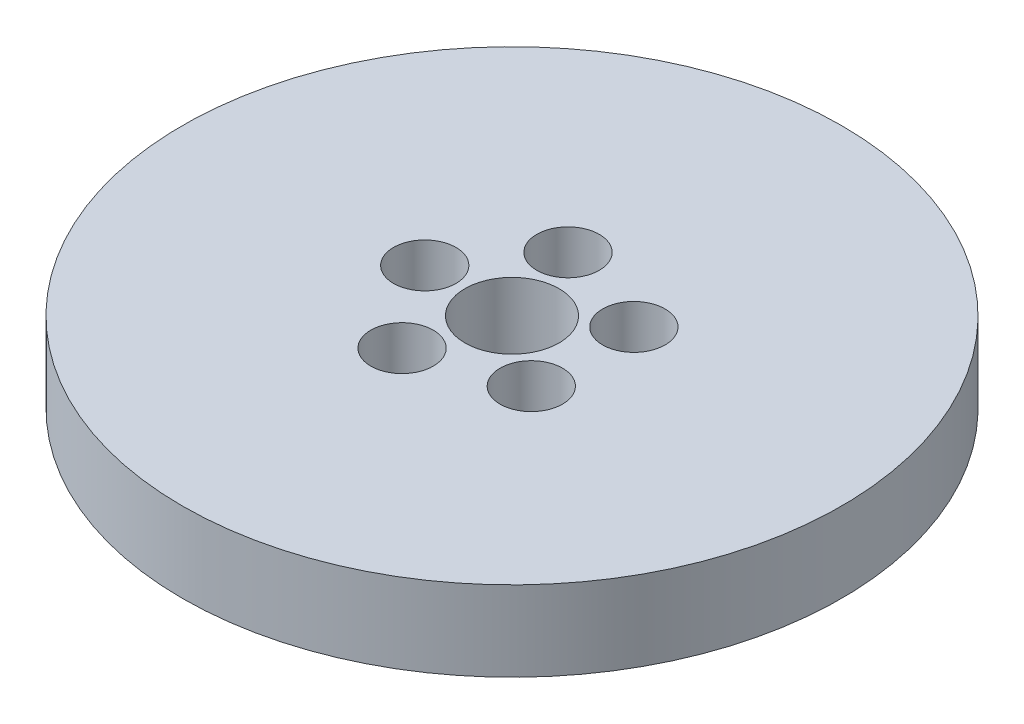
ISO-10303-21;
HEADER;
FILE_DESCRIPTION(('STEP AP214'),'2;1');
FILE_NAME('part.step','',(''),(''),'','','');
FILE_SCHEMA(('AUTOMOTIVE_DESIGN { 1 0 10303 214 1 1 1 1 }'));
ENDSEC;
DATA;
#1=APPLICATION_CONTEXT('core data for automotive mechanical design processes');
#2=APPLICATION_PROTOCOL_DEFINITION('international standard','automotive_design',2000,#1);
#3=PRODUCT_CONTEXT('',#1,'mechanical');
#4=PRODUCT('Part','Part','',(#3));
#5=PRODUCT_RELATED_PRODUCT_CATEGORY('part','',(#4));
#6=PRODUCT_DEFINITION_FORMATION('','',#4);
#7=PRODUCT_DEFINITION_CONTEXT('part definition',#1,'design');
#8=PRODUCT_DEFINITION('design','',#6,#7);
#9=PRODUCT_DEFINITION_SHAPE('','',#8);
#10=(LENGTH_UNIT() NAMED_UNIT(*) SI_UNIT(.MILLI.,.METRE.));
#11=(NAMED_UNIT(*) PLANE_ANGLE_UNIT() SI_UNIT($,.RADIAN.));
#12=(NAMED_UNIT(*) SI_UNIT($,.STERADIAN.) SOLID_ANGLE_UNIT());
#13=UNCERTAINTY_MEASURE_WITH_UNIT(LENGTH_MEASURE(1.E-05),#10,'distance_accuracy_value','');
#14=(GEOMETRIC_REPRESENTATION_CONTEXT(3) GLOBAL_UNCERTAINTY_ASSIGNED_CONTEXT((#13)) GLOBAL_UNIT_ASSIGNED_CONTEXT((#10,
#11,#12)) REPRESENTATION_CONTEXT('',''));
#15=CARTESIAN_POINT('',(0.,0.,0.));
#16=DIRECTION('',(0.,0.,1.));
#17=DIRECTION('',(1.,0.,0.));
#18=AXIS2_PLACEMENT_3D('',#15,#16,#17);
#19=CARTESIAN_POINT('',(0.,17.,0.));
#20=DIRECTION('',(0.,-1.,0.));
#21=DIRECTION('',(0.,0.,-1.));
#22=AXIS2_PLACEMENT_3D('',#19,#20,#21);
#23=CYLINDRICAL_SURFACE('',#22,70.);
#24=CARTESIAN_POINT('',(0.,17.,0.));
#25=DIRECTION('',(0.,1.,0.));
#26=DIRECTION('',(0.,0.,1.));
#27=AXIS2_PLACEMENT_3D('',#24,#25,#26);
#28=CIRCLE('',#27,70.);
#29=CARTESIAN_POINT('',(0.,17.,70.));
#30=VERTEX_POINT('',#29);
#31=EDGE_CURVE('E10',#30,#30,#28,.T.);
#32=ORIENTED_EDGE('',*,*,#31,.F.);
#33=EDGE_LOOP('',(#32));
#34=FACE_BOUND('',#33,.T.);
#35=CARTESIAN_POINT('',(0.,0.,0.));
#36=DIRECTION('',(0.,1.,0.));
#37=DIRECTION('',(0.,0.,1.));
#38=AXIS2_PLACEMENT_3D('',#35,#36,#37);
#39=CIRCLE('',#38,70.);
#40=CARTESIAN_POINT('',(0.,0.,70.));
#41=VERTEX_POINT('',#40);
#42=EDGE_CURVE('E37',#41,#41,#39,.T.);
#43=ORIENTED_EDGE('',*,*,#42,.T.);
#44=EDGE_LOOP('',(#43));
#45=FACE_BOUND('',#44,.T.);
#46=ADVANCED_FACE('F40',(#34,#45),#23,.T.);
#47=CARTESIAN_POINT('',(0.,17.,0.));
#48=DIRECTION('',(0.,1.,0.));
#49=DIRECTION('',(0.,0.,1.));
#50=AXIS2_PLACEMENT_3D('',#47,#48,#49);
#51=PLANE('',#50);
#52=CARTESIAN_POINT('',(-5.72647778566137,17.,-17.6242864069291));
#53=DIRECTION('',(0.,1.,0.));
#54=DIRECTION('',(-0.95105651629515,0.,0.309016994374958));
#55=AXIS2_PLACEMENT_3D('',#52,#53,#54);
#56=CIRCLE('',#55,6.6329048274765);
#57=CARTESIAN_POINT('',(-5.72647778566137,17.,-10.9913815794526));
#58=VERTEX_POINT('',#57);
#59=EDGE_CURVE('E70',#58,#58,#56,.T.);
#60=ORIENTED_EDGE('',*,*,#59,.F.);
#61=EDGE_LOOP('',(#60));
#62=FACE_BOUND('',#61,.T.);
#63=CARTESIAN_POINT('',(14.9921134786821,17.,-10.8924080269451));
#64=DIRECTION('',(0.,1.,0.));
#65=DIRECTION('',(-0.58778525229248,0.,-0.809016994374942));
#66=AXIS2_PLACEMENT_3D('',#63,#64,#65);
#67=CIRCLE('',#66,6.6329048274765);
#68=CARTESIAN_POINT('',(14.9921134786821,17.,-4.25950319946863));
#69=VERTEX_POINT('',#68);
#70=EDGE_CURVE('E71',#69,#69,#67,.T.);
#71=ORIENTED_EDGE('',*,*,#70,.F.);
#72=EDGE_LOOP('',(#71));
#73=FACE_BOUND('',#72,.T.);
#74=CARTESIAN_POINT('',(14.9921134786822,17.,10.8924080269449));
#75=DIRECTION('',(0.,1.,0.));
#76=DIRECTION('',(0.587785252292469,0.,-0.809016994374951));
#77=AXIS2_PLACEMENT_3D('',#74,#75,#76);
#78=CIRCLE('',#77,6.6329048274765);
#79=CARTESIAN_POINT('',(14.9921134786822,17.,17.5253128544214));
#80=VERTEX_POINT('',#79);
#81=EDGE_CURVE('E78',#80,#80,#78,.T.);
#82=ORIENTED_EDGE('',*,*,#81,.F.);
#83=EDGE_LOOP('',(#82));
#84=FACE_BOUND('',#83,.T.);
#85=CARTESIAN_POINT('',(-5.72647778566112,17.,17.6242864069292));
#86=DIRECTION('',(0.,1.,0.));
#87=DIRECTION('',(0.951056516295155,0.,0.309016994374945));
#88=AXIS2_PLACEMENT_3D('',#85,#86,#87);
#89=CIRCLE('',#88,6.6329048274765);
#90=CARTESIAN_POINT('',(-5.72647778566112,17.,24.2571912344057));
#91=VERTEX_POINT('',#90);
#92=EDGE_CURVE('E61',#91,#91,#89,.T.);
#93=ORIENTED_EDGE('',*,*,#92,.F.);
#94=EDGE_LOOP('',(#93));
#95=FACE_BOUND('',#94,.T.);
#96=CARTESIAN_POINT('',(-18.531271386042,17.,0.));
#97=DIRECTION('',(0.,1.,0.));
#98=DIRECTION('',(0.,0.,1.));
#99=AXIS2_PLACEMENT_3D('',#96,#97,#98);
#100=CIRCLE('',#99,6.6329048274765);
#101=CARTESIAN_POINT('',(-18.531271386042,17.,6.6329048274765));
#102=VERTEX_POINT('',#101);
#103=EDGE_CURVE('E54',#102,#102,#100,.T.);
#104=ORIENTED_EDGE('',*,*,#103,.F.);
#105=EDGE_LOOP('',(#104));
#106=FACE_BOUND('',#105,.T.);
#107=CARTESIAN_POINT('',(0.,17.,0.));
#108=DIRECTION('',(0.,1.,0.));
#109=DIRECTION('',(0.,0.,1.));
#110=AXIS2_PLACEMENT_3D('',#107,#108,#109);
#111=CIRCLE('',#110,10.);
#112=CARTESIAN_POINT('',(0.,17.,10.));
#113=VERTEX_POINT('',#112);
#114=EDGE_CURVE('E50',#113,#113,#111,.T.);
#115=ORIENTED_EDGE('',*,*,#114,.F.);
#116=EDGE_LOOP('',(#115));
#117=FACE_BOUND('',#116,.T.);
#118=ORIENTED_EDGE('',*,*,#31,.T.);
#119=EDGE_LOOP('',(#118));
#120=FACE_BOUND('',#119,.T.);
#121=ADVANCED_FACE('F94',(#62,#73,#84,#95,#106,#117,#120),#51,.T.);
#122=CARTESIAN_POINT('',(0.,0.,0.));
#123=DIRECTION('',(0.,1.,0.));
#124=DIRECTION('',(0.,0.,1.));
#125=AXIS2_PLACEMENT_3D('',#122,#123,#124);
#126=PLANE('',#125);
#127=CARTESIAN_POINT('',(0.,0.,0.));
#128=DIRECTION('',(0.,1.,0.));
#129=DIRECTION('',(0.,0.,1.));
#130=AXIS2_PLACEMENT_3D('',#127,#128,#129);
#131=CIRCLE('',#130,10.);
#132=CARTESIAN_POINT('',(0.,0.,10.));
#133=VERTEX_POINT('',#132);
#134=EDGE_CURVE('E47',#133,#133,#131,.T.);
#135=ORIENTED_EDGE('',*,*,#134,.T.);
#136=EDGE_LOOP('',(#135));
#137=FACE_BOUND('',#136,.T.);
#138=ORIENTED_EDGE('',*,*,#42,.F.);
#139=EDGE_LOOP('',(#138));
#140=FACE_BOUND('',#139,.T.);
#141=ADVANCED_FACE('F100',(#137,#140),#126,.F.);
#142=CARTESIAN_POINT('',(0.,17.,0.));
#143=DIRECTION('',(0.,-1.,0.));
#144=DIRECTION('',(0.,0.,-1.));
#145=AXIS2_PLACEMENT_3D('',#142,#143,#144);
#146=CYLINDRICAL_SURFACE('',#145,10.);
#147=ORIENTED_EDGE('',*,*,#114,.T.);
#148=EDGE_LOOP('',(#147));
#149=FACE_BOUND('',#148,.T.);
#150=ORIENTED_EDGE('',*,*,#134,.F.);
#151=EDGE_LOOP('',(#150));
#152=FACE_BOUND('',#151,.T.);
#153=ADVANCED_FACE('F106',(#149,#152),#146,.F.);
#154=CARTESIAN_POINT('',(-18.531271386042,2.63415524458478,0.));
#155=DIRECTION('',(0.,1.,0.));
#156=DIRECTION('',(0.,0.,1.));
#157=AXIS2_PLACEMENT_3D('',#154,#155,#156);
#158=CYLINDRICAL_SURFACE('',#157,6.6329048274765);
#159=CARTESIAN_POINT('',(-18.531271386042,2.63415524458478,0.));
#160=DIRECTION('',(0.,1.,0.));
#161=DIRECTION('',(0.,0.,1.));
#162=AXIS2_PLACEMENT_3D('',#159,#160,#161);
#163=CIRCLE('',#162,6.6329048274765);
#164=CARTESIAN_POINT('',(-18.531271386042,2.63415524458478,6.6329048274765));
#165=VERTEX_POINT('',#164);
#166=EDGE_CURVE('E55',#165,#165,#163,.T.);
#167=CARTESIAN_POINT('',(-18.531271386042,2.63415524458478,6.6329048274765));
#168=CARTESIAN_POINT('',(-18.531271386042,2.78379946078702,6.6329048274765));
#169=CARTESIAN_POINT('',(-18.531271386042,2.93344367698927,6.6329048274765));
#170=CARTESIAN_POINT('',(-18.531271386042,3.23273210939375,6.6329048274765));
#171=CARTESIAN_POINT('',(-18.531271386042,3.38237632559599,6.6329048274765));
#172=CARTESIAN_POINT('',(-18.531271386042,3.68166475800047,6.6329048274765));
#173=CARTESIAN_POINT('',(-18.531271386042,3.83130897420272,6.6329048274765));
#174=CARTESIAN_POINT('',(-18.531271386042,4.1305974066072,6.6329048274765));
#175=CARTESIAN_POINT('',(-18.531271386042,4.28024162280944,6.6329048274765));
#176=CARTESIAN_POINT('',(-18.531271386042,4.57953005521393,6.6329048274765));
#177=CARTESIAN_POINT('',(-18.531271386042,4.72917427141617,6.6329048274765));
#178=CARTESIAN_POINT('',(-18.531271386042,5.02846270382065,6.6329048274765));
#179=CARTESIAN_POINT('',(-18.531271386042,5.17810692002289,6.6329048274765));
#180=CARTESIAN_POINT('',(-18.531271386042,5.47739535242738,6.6329048274765));
#181=CARTESIAN_POINT('',(-18.531271386042,5.62703956862962,6.6329048274765));
#182=CARTESIAN_POINT('',(-18.531271386042,5.9263280010341,6.6329048274765));
#183=CARTESIAN_POINT('',(-18.531271386042,6.07597221723634,6.6329048274765));
#184=CARTESIAN_POINT('',(-18.531271386042,6.37526064964083,6.6329048274765));
#185=CARTESIAN_POINT('',(-18.531271386042,6.52490486584307,6.6329048274765));
#186=CARTESIAN_POINT('',(-18.531271386042,6.82419329824755,6.6329048274765));
#187=CARTESIAN_POINT('',(-18.531271386042,6.9738375144498,6.6329048274765));
#188=CARTESIAN_POINT('',(-18.531271386042,7.27312594685428,6.6329048274765));
#189=CARTESIAN_POINT('',(-18.531271386042,7.42277016305652,6.6329048274765));
#190=CARTESIAN_POINT('',(-18.531271386042,7.722058595461,6.6329048274765));
#191=CARTESIAN_POINT('',(-18.531271386042,7.87170281166325,6.6329048274765));
#192=CARTESIAN_POINT('',(-18.531271386042,8.17099124406773,6.6329048274765));
#193=CARTESIAN_POINT('',(-18.531271386042,8.32063546026997,6.6329048274765));
#194=CARTESIAN_POINT('',(-18.531271386042,8.61992389267446,6.6329048274765));
#195=CARTESIAN_POINT('',(-18.531271386042,8.7695681088767,6.6329048274765));
#196=CARTESIAN_POINT('',(-18.531271386042,9.06885654128118,6.6329048274765));
#197=CARTESIAN_POINT('',(-18.531271386042,9.21850075748342,6.6329048274765));
#198=CARTESIAN_POINT('',(-18.531271386042,9.51778918988791,6.6329048274765));
#199=CARTESIAN_POINT('',(-18.531271386042,9.66743340609015,6.6329048274765));
#200=CARTESIAN_POINT('',(-18.531271386042,9.96672183849463,6.6329048274765));
#201=CARTESIAN_POINT('',(-18.531271386042,10.1163660546969,6.6329048274765));
#202=CARTESIAN_POINT('',(-18.531271386042,10.4156544871014,6.6329048274765));
#203=CARTESIAN_POINT('',(-18.531271386042,10.5652987033036,6.6329048274765));
#204=CARTESIAN_POINT('',(-18.531271386042,10.8645871357081,6.6329048274765));
#205=CARTESIAN_POINT('',(-18.531271386042,11.0142313519103,6.6329048274765));
#206=CARTESIAN_POINT('',(-18.531271386042,11.3135197843148,6.6329048274765));
#207=CARTESIAN_POINT('',(-18.531271386042,11.4631640005171,6.6329048274765));
#208=CARTESIAN_POINT('',(-18.531271386042,11.7624524329215,6.6329048274765));
#209=CARTESIAN_POINT('',(-18.531271386042,11.9120966491238,6.6329048274765));
#210=CARTESIAN_POINT('',(-18.531271386042,12.2113850815283,6.6329048274765));
#211=CARTESIAN_POINT('',(-18.531271386042,12.3610292977305,6.6329048274765));
#212=CARTESIAN_POINT('',(-18.531271386042,12.660317730135,6.6329048274765));
#213=CARTESIAN_POINT('',(-18.531271386042,12.8099619463372,6.6329048274765));
#214=CARTESIAN_POINT('',(-18.531271386042,13.1092503787417,6.6329048274765));
#215=CARTESIAN_POINT('',(-18.531271386042,13.258894594944,6.6329048274765));
#216=CARTESIAN_POINT('',(-18.531271386042,13.5581830273484,6.6329048274765));
#217=CARTESIAN_POINT('',(-18.531271386042,13.7078272435507,6.6329048274765));
#218=CARTESIAN_POINT('',(-18.531271386042,14.0071156759552,6.6329048274765));
#219=CARTESIAN_POINT('',(-18.531271386042,14.1567598921574,6.6329048274765));
#220=CARTESIAN_POINT('',(-18.531271386042,14.4560483245619,6.6329048274765));
#221=CARTESIAN_POINT('',(-18.531271386042,14.6056925407641,6.6329048274765));
#222=CARTESIAN_POINT('',(-18.531271386042,14.9049809731686,6.6329048274765));
#223=CARTESIAN_POINT('',(-18.531271386042,15.0546251893709,6.6329048274765));
#224=CARTESIAN_POINT('',(-18.531271386042,15.3539136217753,6.6329048274765));
#225=CARTESIAN_POINT('',(-18.531271386042,15.5035578379776,6.6329048274765));
#226=CARTESIAN_POINT('',(-18.531271386042,15.8028462703821,6.6329048274765));
#227=CARTESIAN_POINT('',(-18.531271386042,15.9524904865843,6.6329048274765));
#228=CARTESIAN_POINT('',(-18.531271386042,16.2517789189888,6.6329048274765));
#229=CARTESIAN_POINT('',(-18.531271386042,16.401423135191,6.6329048274765));
#230=CARTESIAN_POINT('',(-18.531271386042,16.7007115675955,6.6329048274765));
#231=CARTESIAN_POINT('',(-18.531271386042,16.8503557837978,6.6329048274765));
#232=CARTESIAN_POINT('',(-18.531271386042,17.,6.6329048274765));
#233=B_SPLINE_CURVE_WITH_KNOTS('',3,(#167,#168,#169,#170,#171,#172,#173,#174,#175,#176,#177,
#178,#179,#180,#181,#182,#183,#184,#185,#186,#187,#188,#189,#190,#191,#192,#193,#194,#195,#196,
#197,#198,#199,#200,#201,#202,#203,#204,#205,#206,#207,#208,#209,#210,#211,#212,#213,#214,#215,
#216,#217,#218,#219,#220,#221,#222,#223,#224,#225,#226,#227,#228,#229,#230,#231,#232),
.UNSPECIFIED.,.F.,.F.,(4,2,2,2,2,2,2,2,2,2,2,2,2,2,2,2,2,2,2,2,2,2,2,2,2,2,2,2,2,2,2,2,4),(0.,
0.448932648606725,0.897865297213451,1.34679794582018,1.7957305944269,2.24466324303363,
2.69359589164035,3.14252854024708,3.5914611888538,4.04039383746053,4.48932648606726,
4.93825913467398,5.38719178328071,5.83612443188743,6.28505708049416,6.73398972910088,
7.18292237770761,7.63185502631433,8.08078767492106,8.52972032352778,8.97865297213451,
9.42758562074124,9.87651826934796,10.3254509179547,10.7743835665614,11.2233162151681,
11.6722488637749,12.1211815123816,12.5701141609883,13.019046809595,13.4679794582018,
13.9169121068085,14.3658447554152),.UNSPECIFIED.);
#234=EDGE_CURVE('BSEAM108',#165,#102,#233,.T.);
#235=ORIENTED_EDGE('',*,*,#166,.F.);
#236=ORIENTED_EDGE('',*,*,#103,.T.);
#237=ORIENTED_EDGE('',*,*,#234,.T.);
#238=ORIENTED_EDGE('',*,*,#234,.F.);
#239=EDGE_LOOP('',(#235,#237,#236,#238));
#240=FACE_BOUND('',#239,.T.);
#241=ADVANCED_FACE('F108',(#240),#158,.F.);
#242=CARTESIAN_POINT('',(-18.531271386042,2.63415524458478,0.));
#243=DIRECTION('',(0.,1.,0.));
#244=DIRECTION('',(0.,0.,1.));
#245=AXIS2_PLACEMENT_3D('',#242,#243,#244);
#246=PLANE('',#245);
#247=ORIENTED_EDGE('',*,*,#166,.T.);
#248=EDGE_LOOP('',(#247));
#249=FACE_BOUND('',#248,.T.);
#250=ADVANCED_FACE('F138',(#249),#246,.T.);
#251=CARTESIAN_POINT('',(-5.72647778566112,2.63415524458478,17.6242864069292));
#252=DIRECTION('',(0.,1.,0.));
#253=DIRECTION('',(0.,0.,1.));
#254=AXIS2_PLACEMENT_3D('',#251,#252,#253);
#255=CYLINDRICAL_SURFACE('',#254,6.6329048274765);
#256=CARTESIAN_POINT('',(-5.72647778566112,2.63415524458478,17.6242864069292));
#257=DIRECTION('',(0.,1.,0.));
#258=DIRECTION('',(0.951056516295155,0.,0.309016994374945));
#259=AXIS2_PLACEMENT_3D('',#256,#257,#258);
#260=CIRCLE('',#259,6.6329048274765);
#261=CARTESIAN_POINT('',(-5.72647778566112,2.63415524458478,24.2571912344057));
#262=VERTEX_POINT('',#261);
#263=EDGE_CURVE('E59',#262,#262,#260,.T.);
#264=CARTESIAN_POINT('',(-5.72647778566112,2.63415524458478,24.2571912344057));
#265=CARTESIAN_POINT('',(-5.72647778566112,2.78379946078702,24.2571912344057));
#266=CARTESIAN_POINT('',(-5.72647778566112,2.93344367698927,24.2571912344057));
#267=CARTESIAN_POINT('',(-5.72647778566112,3.23273210939375,24.2571912344057));
#268=CARTESIAN_POINT('',(-5.72647778566112,3.38237632559599,24.2571912344057));
#269=CARTESIAN_POINT('',(-5.72647778566112,3.68166475800047,24.2571912344057));
#270=CARTESIAN_POINT('',(-5.72647778566112,3.83130897420272,24.2571912344057));
#271=CARTESIAN_POINT('',(-5.72647778566112,4.1305974066072,24.2571912344057));
#272=CARTESIAN_POINT('',(-5.72647778566112,4.28024162280944,24.2571912344057));
#273=CARTESIAN_POINT('',(-5.72647778566112,4.57953005521393,24.2571912344057));
#274=CARTESIAN_POINT('',(-5.72647778566112,4.72917427141617,24.2571912344057));
#275=CARTESIAN_POINT('',(-5.72647778566112,5.02846270382065,24.2571912344057));
#276=CARTESIAN_POINT('',(-5.72647778566112,5.17810692002289,24.2571912344057));
#277=CARTESIAN_POINT('',(-5.72647778566112,5.47739535242738,24.2571912344057));
#278=CARTESIAN_POINT('',(-5.72647778566112,5.62703956862962,24.2571912344057));
#279=CARTESIAN_POINT('',(-5.72647778566112,5.9263280010341,24.2571912344057));
#280=CARTESIAN_POINT('',(-5.72647778566112,6.07597221723634,24.2571912344057));
#281=CARTESIAN_POINT('',(-5.72647778566112,6.37526064964083,24.2571912344057));
#282=CARTESIAN_POINT('',(-5.72647778566112,6.52490486584307,24.2571912344057));
#283=CARTESIAN_POINT('',(-5.72647778566112,6.82419329824755,24.2571912344057));
#284=CARTESIAN_POINT('',(-5.72647778566112,6.9738375144498,24.2571912344057));
#285=CARTESIAN_POINT('',(-5.72647778566112,7.27312594685428,24.2571912344057));
#286=CARTESIAN_POINT('',(-5.72647778566112,7.42277016305652,24.2571912344057));
#287=CARTESIAN_POINT('',(-5.72647778566112,7.722058595461,24.2571912344057));
#288=CARTESIAN_POINT('',(-5.72647778566112,7.87170281166325,24.2571912344057));
#289=CARTESIAN_POINT('',(-5.72647778566112,8.17099124406773,24.2571912344057));
#290=CARTESIAN_POINT('',(-5.72647778566112,8.32063546026997,24.2571912344057));
#291=CARTESIAN_POINT('',(-5.72647778566112,8.61992389267446,24.2571912344057));
#292=CARTESIAN_POINT('',(-5.72647778566112,8.7695681088767,24.2571912344057));
#293=CARTESIAN_POINT('',(-5.72647778566112,9.06885654128118,24.2571912344057));
#294=CARTESIAN_POINT('',(-5.72647778566112,9.21850075748342,24.2571912344057));
#295=CARTESIAN_POINT('',(-5.72647778566112,9.51778918988791,24.2571912344057));
#296=CARTESIAN_POINT('',(-5.72647778566112,9.66743340609015,24.2571912344057));
#297=CARTESIAN_POINT('',(-5.72647778566112,9.96672183849463,24.2571912344057));
#298=CARTESIAN_POINT('',(-5.72647778566112,10.1163660546969,24.2571912344057));
#299=CARTESIAN_POINT('',(-5.72647778566112,10.4156544871014,24.2571912344057));
#300=CARTESIAN_POINT('',(-5.72647778566112,10.5652987033036,24.2571912344057));
#301=CARTESIAN_POINT('',(-5.72647778566112,10.8645871357081,24.2571912344057));
#302=CARTESIAN_POINT('',(-5.72647778566112,11.0142313519103,24.2571912344057));
#303=CARTESIAN_POINT('',(-5.72647778566112,11.3135197843148,24.2571912344057));
#304=CARTESIAN_POINT('',(-5.72647778566112,11.4631640005171,24.2571912344057));
#305=CARTESIAN_POINT('',(-5.72647778566112,11.7624524329215,24.2571912344057));
#306=CARTESIAN_POINT('',(-5.72647778566112,11.9120966491238,24.2571912344057));
#307=CARTESIAN_POINT('',(-5.72647778566112,12.2113850815283,24.2571912344057));
#308=CARTESIAN_POINT('',(-5.72647778566112,12.3610292977305,24.2571912344057));
#309=CARTESIAN_POINT('',(-5.72647778566112,12.660317730135,24.2571912344057));
#310=CARTESIAN_POINT('',(-5.72647778566112,12.8099619463372,24.2571912344057));
#311=CARTESIAN_POINT('',(-5.72647778566112,13.1092503787417,24.2571912344057));
#312=CARTESIAN_POINT('',(-5.72647778566112,13.258894594944,24.2571912344057));
#313=CARTESIAN_POINT('',(-5.72647778566112,13.5581830273484,24.2571912344057));
#314=CARTESIAN_POINT('',(-5.72647778566112,13.7078272435507,24.2571912344057));
#315=CARTESIAN_POINT('',(-5.72647778566112,14.0071156759552,24.2571912344057));
#316=CARTESIAN_POINT('',(-5.72647778566112,14.1567598921574,24.2571912344057));
#317=CARTESIAN_POINT('',(-5.72647778566112,14.4560483245619,24.2571912344057));
#318=CARTESIAN_POINT('',(-5.72647778566112,14.6056925407641,24.2571912344057));
#319=CARTESIAN_POINT('',(-5.72647778566112,14.9049809731686,24.2571912344057));
#320=CARTESIAN_POINT('',(-5.72647778566112,15.0546251893709,24.2571912344057));
#321=CARTESIAN_POINT('',(-5.72647778566112,15.3539136217753,24.2571912344057));
#322=CARTESIAN_POINT('',(-5.72647778566112,15.5035578379776,24.2571912344057));
#323=CARTESIAN_POINT('',(-5.72647778566112,15.8028462703821,24.2571912344057));
#324=CARTESIAN_POINT('',(-5.72647778566112,15.9524904865843,24.2571912344057));
#325=CARTESIAN_POINT('',(-5.72647778566112,16.2517789189888,24.2571912344057));
#326=CARTESIAN_POINT('',(-5.72647778566112,16.401423135191,24.2571912344057));
#327=CARTESIAN_POINT('',(-5.72647778566112,16.7007115675955,24.2571912344057));
#328=CARTESIAN_POINT('',(-5.72647778566112,16.8503557837978,24.2571912344057));
#329=CARTESIAN_POINT('',(-5.72647778566112,17.,24.2571912344057));
#330=B_SPLINE_CURVE_WITH_KNOTS('',3,(#264,#265,#266,#267,#268,#269,#270,#271,#272,#273,#274,
#275,#276,#277,#278,#279,#280,#281,#282,#283,#284,#285,#286,#287,#288,#289,#290,#291,#292,#293,
#294,#295,#296,#297,#298,#299,#300,#301,#302,#303,#304,#305,#306,#307,#308,#309,#310,#311,#312,
#313,#314,#315,#316,#317,#318,#319,#320,#321,#322,#323,#324,#325,#326,#327,#328,#329),
.UNSPECIFIED.,.F.,.F.,(4,2,2,2,2,2,2,2,2,2,2,2,2,2,2,2,2,2,2,2,2,2,2,2,2,2,2,2,2,2,2,2,4),(0.,
0.448932648606725,0.897865297213451,1.34679794582018,1.7957305944269,2.24466324303363,
2.69359589164035,3.14252854024708,3.5914611888538,4.04039383746053,4.48932648606726,
4.93825913467398,5.38719178328071,5.83612443188743,6.28505708049416,6.73398972910088,
7.18292237770761,7.63185502631433,8.08078767492106,8.52972032352778,8.97865297213451,
9.42758562074124,9.87651826934796,10.3254509179547,10.7743835665614,11.2233162151681,
11.6722488637749,12.1211815123816,12.5701141609883,13.019046809595,13.4679794582018,
13.9169121068085,14.3658447554152),.UNSPECIFIED.);
#331=EDGE_CURVE('BSEAM150',#262,#91,#330,.T.);
#332=ORIENTED_EDGE('',*,*,#263,.F.);
#333=ORIENTED_EDGE('',*,*,#92,.T.);
#334=ORIENTED_EDGE('',*,*,#331,.T.);
#335=ORIENTED_EDGE('',*,*,#331,.F.);
#336=EDGE_LOOP('',(#332,#334,#333,#335));
#337=FACE_BOUND('',#336,.T.);
#338=ADVANCED_FACE('F150',(#337),#255,.F.);
#339=CARTESIAN_POINT('',(-5.72647778566112,2.63415524458478,17.6242864069292));
#340=DIRECTION('',(0.,1.,0.));
#341=DIRECTION('',(0.951056516295155,0.,0.309016994374945));
#342=AXIS2_PLACEMENT_3D('',#339,#340,#341);
#343=PLANE('',#342);
#344=ORIENTED_EDGE('',*,*,#263,.T.);
#345=EDGE_LOOP('',(#344));
#346=FACE_BOUND('',#345,.T.);
#347=ADVANCED_FACE('F89',(#346),#343,.T.);
#348=CARTESIAN_POINT('',(14.9921134786822,2.63415524458478,10.8924080269449));
#349=DIRECTION('',(0.,1.,0.));
#350=DIRECTION('',(0.,0.,1.));
#351=AXIS2_PLACEMENT_3D('',#348,#349,#350);
#352=CYLINDRICAL_SURFACE('',#351,6.6329048274765);
#353=CARTESIAN_POINT('',(14.9921134786822,2.63415524458478,10.8924080269449));
#354=DIRECTION('',(0.,1.,0.));
#355=DIRECTION('',(0.587785252292469,0.,-0.809016994374951));
#356=AXIS2_PLACEMENT_3D('',#353,#354,#355);
#357=CIRCLE('',#356,6.6329048274765);
#358=CARTESIAN_POINT('',(14.9921134786822,2.63415524458478,17.5253128544214));
#359=VERTEX_POINT('',#358);
#360=EDGE_CURVE('E63',#359,#359,#357,.T.);
#361=CARTESIAN_POINT('',(14.9921134786822,2.63415524458478,17.5253128544214));
#362=CARTESIAN_POINT('',(14.9921134786822,2.78379946078702,17.5253128544214));
#363=CARTESIAN_POINT('',(14.9921134786822,2.93344367698927,17.5253128544214));
#364=CARTESIAN_POINT('',(14.9921134786822,3.23273210939375,17.5253128544214));
#365=CARTESIAN_POINT('',(14.9921134786822,3.38237632559599,17.5253128544214));
#366=CARTESIAN_POINT('',(14.9921134786822,3.68166475800047,17.5253128544214));
#367=CARTESIAN_POINT('',(14.9921134786822,3.83130897420272,17.5253128544214));
#368=CARTESIAN_POINT('',(14.9921134786822,4.1305974066072,17.5253128544214));
#369=CARTESIAN_POINT('',(14.9921134786822,4.28024162280944,17.5253128544214));
#370=CARTESIAN_POINT('',(14.9921134786822,4.57953005521393,17.5253128544214));
#371=CARTESIAN_POINT('',(14.9921134786822,4.72917427141617,17.5253128544214));
#372=CARTESIAN_POINT('',(14.9921134786822,5.02846270382065,17.5253128544214));
#373=CARTESIAN_POINT('',(14.9921134786822,5.17810692002289,17.5253128544214));
#374=CARTESIAN_POINT('',(14.9921134786822,5.47739535242738,17.5253128544214));
#375=CARTESIAN_POINT('',(14.9921134786822,5.62703956862962,17.5253128544214));
#376=CARTESIAN_POINT('',(14.9921134786822,5.9263280010341,17.5253128544214));
#377=CARTESIAN_POINT('',(14.9921134786822,6.07597221723634,17.5253128544214));
#378=CARTESIAN_POINT('',(14.9921134786822,6.37526064964083,17.5253128544214));
#379=CARTESIAN_POINT('',(14.9921134786822,6.52490486584307,17.5253128544214));
#380=CARTESIAN_POINT('',(14.9921134786822,6.82419329824755,17.5253128544214));
#381=CARTESIAN_POINT('',(14.9921134786822,6.9738375144498,17.5253128544214));
#382=CARTESIAN_POINT('',(14.9921134786822,7.27312594685428,17.5253128544214));
#383=CARTESIAN_POINT('',(14.9921134786822,7.42277016305652,17.5253128544214));
#384=CARTESIAN_POINT('',(14.9921134786822,7.722058595461,17.5253128544214));
#385=CARTESIAN_POINT('',(14.9921134786822,7.87170281166325,17.5253128544214));
#386=CARTESIAN_POINT('',(14.9921134786822,8.17099124406773,17.5253128544214));
#387=CARTESIAN_POINT('',(14.9921134786822,8.32063546026997,17.5253128544214));
#388=CARTESIAN_POINT('',(14.9921134786822,8.61992389267446,17.5253128544214));
#389=CARTESIAN_POINT('',(14.9921134786822,8.7695681088767,17.5253128544214));
#390=CARTESIAN_POINT('',(14.9921134786822,9.06885654128118,17.5253128544214));
#391=CARTESIAN_POINT('',(14.9921134786822,9.21850075748342,17.5253128544214));
#392=CARTESIAN_POINT('',(14.9921134786822,9.51778918988791,17.5253128544214));
#393=CARTESIAN_POINT('',(14.9921134786822,9.66743340609015,17.5253128544214));
#394=CARTESIAN_POINT('',(14.9921134786822,9.96672183849463,17.5253128544214));
#395=CARTESIAN_POINT('',(14.9921134786822,10.1163660546969,17.5253128544214));
#396=CARTESIAN_POINT('',(14.9921134786822,10.4156544871014,17.5253128544214));
#397=CARTESIAN_POINT('',(14.9921134786822,10.5652987033036,17.5253128544214));
#398=CARTESIAN_POINT('',(14.9921134786822,10.8645871357081,17.5253128544214));
#399=CARTESIAN_POINT('',(14.9921134786822,11.0142313519103,17.5253128544214));
#400=CARTESIAN_POINT('',(14.9921134786822,11.3135197843148,17.5253128544214));
#401=CARTESIAN_POINT('',(14.9921134786822,11.4631640005171,17.5253128544214));
#402=CARTESIAN_POINT('',(14.9921134786822,11.7624524329215,17.5253128544214));
#403=CARTESIAN_POINT('',(14.9921134786822,11.9120966491238,17.5253128544214));
#404=CARTESIAN_POINT('',(14.9921134786822,12.2113850815283,17.5253128544214));
#405=CARTESIAN_POINT('',(14.9921134786822,12.3610292977305,17.5253128544214));
#406=CARTESIAN_POINT('',(14.9921134786822,12.660317730135,17.5253128544214));
#407=CARTESIAN_POINT('',(14.9921134786822,12.8099619463372,17.5253128544214));
#408=CARTESIAN_POINT('',(14.9921134786822,13.1092503787417,17.5253128544214));
#409=CARTESIAN_POINT('',(14.9921134786822,13.258894594944,17.5253128544214));
#410=CARTESIAN_POINT('',(14.9921134786822,13.5581830273484,17.5253128544214));
#411=CARTESIAN_POINT('',(14.9921134786822,13.7078272435507,17.5253128544214));
#412=CARTESIAN_POINT('',(14.9921134786822,14.0071156759552,17.5253128544214));
#413=CARTESIAN_POINT('',(14.9921134786822,14.1567598921574,17.5253128544214));
#414=CARTESIAN_POINT('',(14.9921134786822,14.4560483245619,17.5253128544214));
#415=CARTESIAN_POINT('',(14.9921134786822,14.6056925407641,17.5253128544214));
#416=CARTESIAN_POINT('',(14.9921134786822,14.9049809731686,17.5253128544214));
#417=CARTESIAN_POINT('',(14.9921134786822,15.0546251893709,17.5253128544214));
#418=CARTESIAN_POINT('',(14.9921134786822,15.3539136217753,17.5253128544214));
#419=CARTESIAN_POINT('',(14.9921134786822,15.5035578379776,17.5253128544214));
#420=CARTESIAN_POINT('',(14.9921134786822,15.8028462703821,17.5253128544214));
#421=CARTESIAN_POINT('',(14.9921134786822,15.9524904865843,17.5253128544214));
#422=CARTESIAN_POINT('',(14.9921134786822,16.2517789189888,17.5253128544214));
#423=CARTESIAN_POINT('',(14.9921134786822,16.401423135191,17.5253128544214));
#424=CARTESIAN_POINT('',(14.9921134786822,16.7007115675955,17.5253128544214));
#425=CARTESIAN_POINT('',(14.9921134786822,16.8503557837978,17.5253128544214));
#426=CARTESIAN_POINT('',(14.9921134786822,17.,17.5253128544214));
#427=B_SPLINE_CURVE_WITH_KNOTS('',3,(#361,#362,#363,#364,#365,#366,#367,#368,#369,#370,#371,
#372,#373,#374,#375,#376,#377,#378,#379,#380,#381,#382,#383,#384,#385,#386,#387,#388,#389,#390,
#391,#392,#393,#394,#395,#396,#397,#398,#399,#400,#401,#402,#403,#404,#405,#406,#407,#408,#409,
#410,#411,#412,#413,#414,#415,#416,#417,#418,#419,#420,#421,#422,#423,#424,#425,#426),
.UNSPECIFIED.,.F.,.F.,(4,2,2,2,2,2,2,2,2,2,2,2,2,2,2,2,2,2,2,2,2,2,2,2,2,2,2,2,2,2,2,2,4),(0.,
0.448932648606725,0.897865297213451,1.34679794582018,1.7957305944269,2.24466324303363,
2.69359589164035,3.14252854024708,3.5914611888538,4.04039383746053,4.48932648606726,
4.93825913467398,5.38719178328071,5.83612443188743,6.28505708049416,6.73398972910088,
7.18292237770761,7.63185502631433,8.08078767492106,8.52972032352778,8.97865297213451,
9.42758562074124,9.87651826934796,10.3254509179547,10.7743835665614,11.2233162151681,
11.6722488637749,12.1211815123816,12.5701141609883,13.019046809595,13.4679794582018,
13.9169121068085,14.3658447554152),.UNSPECIFIED.);
#428=EDGE_CURVE('BSEAM87',#359,#80,#427,.T.);
#429=ORIENTED_EDGE('',*,*,#360,.F.);
#430=ORIENTED_EDGE('',*,*,#81,.T.);
#431=ORIENTED_EDGE('',*,*,#428,.T.);
#432=ORIENTED_EDGE('',*,*,#428,.F.);
#433=EDGE_LOOP('',(#429,#431,#430,#432));
#434=FACE_BOUND('',#433,.T.);
#435=ADVANCED_FACE('F87',(#434),#352,.F.);
#436=CARTESIAN_POINT('',(14.9921134786822,2.63415524458478,10.8924080269449));
#437=DIRECTION('',(0.,1.,0.));
#438=DIRECTION('',(0.587785252292469,0.,-0.809016994374951));
#439=AXIS2_PLACEMENT_3D('',#436,#437,#438);
#440=PLANE('',#439);
#441=ORIENTED_EDGE('',*,*,#360,.T.);
#442=EDGE_LOOP('',(#441));
#443=FACE_BOUND('',#442,.T.);
#444=ADVANCED_FACE('F84',(#443),#440,.T.);
#445=CARTESIAN_POINT('',(14.9921134786821,2.63415524458478,-10.8924080269451));
#446=DIRECTION('',(0.,1.,0.));
#447=DIRECTION('',(0.,0.,1.));
#448=AXIS2_PLACEMENT_3D('',#445,#446,#447);
#449=CYLINDRICAL_SURFACE('',#448,6.6329048274765);
#450=CARTESIAN_POINT('',(14.9921134786821,2.63415524458478,-10.8924080269451));
#451=DIRECTION('',(0.,1.,0.));
#452=DIRECTION('',(-0.58778525229248,0.,-0.809016994374942));
#453=AXIS2_PLACEMENT_3D('',#450,#451,#452);
#454=CIRCLE('',#453,6.6329048274765);
#455=CARTESIAN_POINT('',(14.9921134786821,2.63415524458478,-4.25950319946863));
#456=VERTEX_POINT('',#455);
#457=EDGE_CURVE('E76',#456,#456,#454,.T.);
#458=CARTESIAN_POINT('',(14.9921134786821,2.63415524458478,-4.25950319946863));
#459=CARTESIAN_POINT('',(14.9921134786821,2.78379946078702,-4.25950319946863));
#460=CARTESIAN_POINT('',(14.9921134786821,2.93344367698927,-4.25950319946863));
#461=CARTESIAN_POINT('',(14.9921134786821,3.23273210939375,-4.25950319946863));
#462=CARTESIAN_POINT('',(14.9921134786821,3.38237632559599,-4.25950319946863));
#463=CARTESIAN_POINT('',(14.9921134786821,3.68166475800047,-4.25950319946863));
#464=CARTESIAN_POINT('',(14.9921134786821,3.83130897420272,-4.25950319946863));
#465=CARTESIAN_POINT('',(14.9921134786821,4.1305974066072,-4.25950319946863));
#466=CARTESIAN_POINT('',(14.9921134786821,4.28024162280944,-4.25950319946863));
#467=CARTESIAN_POINT('',(14.9921134786821,4.57953005521393,-4.25950319946863));
#468=CARTESIAN_POINT('',(14.9921134786821,4.72917427141617,-4.25950319946863));
#469=CARTESIAN_POINT('',(14.9921134786821,5.02846270382065,-4.25950319946863));
#470=CARTESIAN_POINT('',(14.9921134786821,5.17810692002289,-4.25950319946863));
#471=CARTESIAN_POINT('',(14.9921134786821,5.47739535242738,-4.25950319946863));
#472=CARTESIAN_POINT('',(14.9921134786821,5.62703956862962,-4.25950319946863));
#473=CARTESIAN_POINT('',(14.9921134786821,5.9263280010341,-4.25950319946863));
#474=CARTESIAN_POINT('',(14.9921134786821,6.07597221723634,-4.25950319946863));
#475=CARTESIAN_POINT('',(14.9921134786821,6.37526064964083,-4.25950319946863));
#476=CARTESIAN_POINT('',(14.9921134786821,6.52490486584307,-4.25950319946863));
#477=CARTESIAN_POINT('',(14.9921134786821,6.82419329824755,-4.25950319946863));
#478=CARTESIAN_POINT('',(14.9921134786821,6.9738375144498,-4.25950319946863));
#479=CARTESIAN_POINT('',(14.9921134786821,7.27312594685428,-4.25950319946863));
#480=CARTESIAN_POINT('',(14.9921134786821,7.42277016305652,-4.25950319946863));
#481=CARTESIAN_POINT('',(14.9921134786821,7.722058595461,-4.25950319946863));
#482=CARTESIAN_POINT('',(14.9921134786821,7.87170281166325,-4.25950319946863));
#483=CARTESIAN_POINT('',(14.9921134786821,8.17099124406773,-4.25950319946863));
#484=CARTESIAN_POINT('',(14.9921134786821,8.32063546026997,-4.25950319946863));
#485=CARTESIAN_POINT('',(14.9921134786821,8.61992389267446,-4.25950319946863));
#486=CARTESIAN_POINT('',(14.9921134786821,8.7695681088767,-4.25950319946863));
#487=CARTESIAN_POINT('',(14.9921134786821,9.06885654128118,-4.25950319946863));
#488=CARTESIAN_POINT('',(14.9921134786821,9.21850075748342,-4.25950319946863));
#489=CARTESIAN_POINT('',(14.9921134786821,9.51778918988791,-4.25950319946863));
#490=CARTESIAN_POINT('',(14.9921134786821,9.66743340609015,-4.25950319946863));
#491=CARTESIAN_POINT('',(14.9921134786821,9.96672183849463,-4.25950319946863));
#492=CARTESIAN_POINT('',(14.9921134786821,10.1163660546969,-4.25950319946863));
#493=CARTESIAN_POINT('',(14.9921134786821,10.4156544871014,-4.25950319946863));
#494=CARTESIAN_POINT('',(14.9921134786821,10.5652987033036,-4.25950319946863));
#495=CARTESIAN_POINT('',(14.9921134786821,10.8645871357081,-4.25950319946863));
#496=CARTESIAN_POINT('',(14.9921134786821,11.0142313519103,-4.25950319946863));
#497=CARTESIAN_POINT('',(14.9921134786821,11.3135197843148,-4.25950319946863));
#498=CARTESIAN_POINT('',(14.9921134786821,11.4631640005171,-4.25950319946863));
#499=CARTESIAN_POINT('',(14.9921134786821,11.7624524329215,-4.25950319946863));
#500=CARTESIAN_POINT('',(14.9921134786821,11.9120966491238,-4.25950319946863));
#501=CARTESIAN_POINT('',(14.9921134786821,12.2113850815283,-4.25950319946863));
#502=CARTESIAN_POINT('',(14.9921134786821,12.3610292977305,-4.25950319946863));
#503=CARTESIAN_POINT('',(14.9921134786821,12.660317730135,-4.25950319946863));
#504=CARTESIAN_POINT('',(14.9921134786821,12.8099619463372,-4.25950319946863));
#505=CARTESIAN_POINT('',(14.9921134786821,13.1092503787417,-4.25950319946863));
#506=CARTESIAN_POINT('',(14.9921134786821,13.258894594944,-4.25950319946863));
#507=CARTESIAN_POINT('',(14.9921134786821,13.5581830273484,-4.25950319946863));
#508=CARTESIAN_POINT('',(14.9921134786821,13.7078272435507,-4.25950319946863));
#509=CARTESIAN_POINT('',(14.9921134786821,14.0071156759552,-4.25950319946863));
#510=CARTESIAN_POINT('',(14.9921134786821,14.1567598921574,-4.25950319946863));
#511=CARTESIAN_POINT('',(14.9921134786821,14.4560483245619,-4.25950319946863));
#512=CARTESIAN_POINT('',(14.9921134786821,14.6056925407641,-4.25950319946863));
#513=CARTESIAN_POINT('',(14.9921134786821,14.9049809731686,-4.25950319946863));
#514=CARTESIAN_POINT('',(14.9921134786821,15.0546251893709,-4.25950319946863));
#515=CARTESIAN_POINT('',(14.9921134786821,15.3539136217753,-4.25950319946863));
#516=CARTESIAN_POINT('',(14.9921134786821,15.5035578379776,-4.25950319946863));
#517=CARTESIAN_POINT('',(14.9921134786821,15.8028462703821,-4.25950319946863));
#518=CARTESIAN_POINT('',(14.9921134786821,15.9524904865843,-4.25950319946863));
#519=CARTESIAN_POINT('',(14.9921134786821,16.2517789189888,-4.25950319946863));
#520=CARTESIAN_POINT('',(14.9921134786821,16.401423135191,-4.25950319946863));
#521=CARTESIAN_POINT('',(14.9921134786821,16.7007115675955,-4.25950319946863));
#522=CARTESIAN_POINT('',(14.9921134786821,16.8503557837978,-4.25950319946863));
#523=CARTESIAN_POINT('',(14.9921134786821,17.,-4.25950319946863));
#524=B_SPLINE_CURVE_WITH_KNOTS('',3,(#458,#459,#460,#461,#462,#463,#464,#465,#466,#467,#468,
#469,#470,#471,#472,#473,#474,#475,#476,#477,#478,#479,#480,#481,#482,#483,#484,#485,#486,#487,
#488,#489,#490,#491,#492,#493,#494,#495,#496,#497,#498,#499,#500,#501,#502,#503,#504,#505,#506,
#507,#508,#509,#510,#511,#512,#513,#514,#515,#516,#517,#518,#519,#520,#521,#522,#523),
.UNSPECIFIED.,.F.,.F.,(4,2,2,2,2,2,2,2,2,2,2,2,2,2,2,2,2,2,2,2,2,2,2,2,2,2,2,2,2,2,2,2,4),(0.,
0.448932648606725,0.897865297213451,1.34679794582018,1.7957305944269,2.24466324303363,
2.69359589164035,3.14252854024708,3.5914611888538,4.04039383746053,4.48932648606726,
4.93825913467398,5.38719178328071,5.83612443188743,6.28505708049416,6.73398972910088,
7.18292237770761,7.63185502631433,8.08078767492106,8.52972032352778,8.97865297213451,
9.42758562074124,9.87651826934796,10.3254509179547,10.7743835665614,11.2233162151681,
11.6722488637749,12.1211815123816,12.5701141609883,13.019046809595,13.4679794582018,
13.9169121068085,14.3658447554152),.UNSPECIFIED.);
#525=EDGE_CURVE('BSEAM185',#456,#69,#524,.T.);
#526=ORIENTED_EDGE('',*,*,#457,.F.);
#527=ORIENTED_EDGE('',*,*,#70,.T.);
#528=ORIENTED_EDGE('',*,*,#525,.T.);
#529=ORIENTED_EDGE('',*,*,#525,.F.);
#530=EDGE_LOOP('',(#526,#528,#527,#529));
#531=FACE_BOUND('',#530,.T.);
#532=ADVANCED_FACE('F185',(#531),#449,.F.);
#533=CARTESIAN_POINT('',(14.9921134786821,2.63415524458478,-10.8924080269451));
#534=DIRECTION('',(0.,1.,0.));
#535=DIRECTION('',(-0.58778525229248,0.,-0.809016994374942));
#536=AXIS2_PLACEMENT_3D('',#533,#534,#535);
#537=PLANE('',#536);
#538=ORIENTED_EDGE('',*,*,#457,.T.);
#539=EDGE_LOOP('',(#538));
#540=FACE_BOUND('',#539,.T.);
#541=ADVANCED_FACE('F189',(#540),#537,.T.);
#542=CARTESIAN_POINT('',(-5.72647778566137,2.63415524458478,-17.6242864069291));
#543=DIRECTION('',(0.,1.,0.));
#544=DIRECTION('',(0.,0.,1.));
#545=AXIS2_PLACEMENT_3D('',#542,#543,#544);
#546=CYLINDRICAL_SURFACE('',#545,6.6329048274765);
#547=CARTESIAN_POINT('',(-5.72647778566137,2.63415524458478,-17.6242864069291));
#548=DIRECTION('',(0.,1.,0.));
#549=DIRECTION('',(-0.95105651629515,0.,0.309016994374958));
#550=AXIS2_PLACEMENT_3D('',#547,#548,#549);
#551=CIRCLE('',#550,6.6329048274765);
#552=CARTESIAN_POINT('',(-5.72647778566137,2.63415524458478,-10.9913815794526));
#553=VERTEX_POINT('',#552);
#554=EDGE_CURVE('E69',#553,#553,#551,.T.);
#555=CARTESIAN_POINT('',(-5.72647778566137,2.63415524458478,-10.9913815794526));
#556=CARTESIAN_POINT('',(-5.72647778566137,2.78379946078702,-10.9913815794526));
#557=CARTESIAN_POINT('',(-5.72647778566137,2.93344367698927,-10.9913815794526));
#558=CARTESIAN_POINT('',(-5.72647778566137,3.23273210939375,-10.9913815794526));
#559=CARTESIAN_POINT('',(-5.72647778566137,3.38237632559599,-10.9913815794526));
#560=CARTESIAN_POINT('',(-5.72647778566137,3.68166475800047,-10.9913815794526));
#561=CARTESIAN_POINT('',(-5.72647778566137,3.83130897420272,-10.9913815794526));
#562=CARTESIAN_POINT('',(-5.72647778566137,4.1305974066072,-10.9913815794526));
#563=CARTESIAN_POINT('',(-5.72647778566137,4.28024162280944,-10.9913815794526));
#564=CARTESIAN_POINT('',(-5.72647778566137,4.57953005521393,-10.9913815794526));
#565=CARTESIAN_POINT('',(-5.72647778566137,4.72917427141617,-10.9913815794526));
#566=CARTESIAN_POINT('',(-5.72647778566137,5.02846270382065,-10.9913815794526));
#567=CARTESIAN_POINT('',(-5.72647778566137,5.17810692002289,-10.9913815794526));
#568=CARTESIAN_POINT('',(-5.72647778566137,5.47739535242738,-10.9913815794526));
#569=CARTESIAN_POINT('',(-5.72647778566137,5.62703956862962,-10.9913815794526));
#570=CARTESIAN_POINT('',(-5.72647778566137,5.9263280010341,-10.9913815794526));
#571=CARTESIAN_POINT('',(-5.72647778566137,6.07597221723634,-10.9913815794526));
#572=CARTESIAN_POINT('',(-5.72647778566137,6.37526064964083,-10.9913815794526));
#573=CARTESIAN_POINT('',(-5.72647778566137,6.52490486584307,-10.9913815794526));
#574=CARTESIAN_POINT('',(-5.72647778566137,6.82419329824755,-10.9913815794526));
#575=CARTESIAN_POINT('',(-5.72647778566137,6.9738375144498,-10.9913815794526));
#576=CARTESIAN_POINT('',(-5.72647778566137,7.27312594685428,-10.9913815794526));
#577=CARTESIAN_POINT('',(-5.72647778566137,7.42277016305652,-10.9913815794526));
#578=CARTESIAN_POINT('',(-5.72647778566137,7.722058595461,-10.9913815794526));
#579=CARTESIAN_POINT('',(-5.72647778566137,7.87170281166325,-10.9913815794526));
#580=CARTESIAN_POINT('',(-5.72647778566137,8.17099124406773,-10.9913815794526));
#581=CARTESIAN_POINT('',(-5.72647778566137,8.32063546026997,-10.9913815794526));
#582=CARTESIAN_POINT('',(-5.72647778566137,8.61992389267446,-10.9913815794526));
#583=CARTESIAN_POINT('',(-5.72647778566137,8.7695681088767,-10.9913815794526));
#584=CARTESIAN_POINT('',(-5.72647778566137,9.06885654128118,-10.9913815794526));
#585=CARTESIAN_POINT('',(-5.72647778566137,9.21850075748342,-10.9913815794526));
#586=CARTESIAN_POINT('',(-5.72647778566137,9.51778918988791,-10.9913815794526));
#587=CARTESIAN_POINT('',(-5.72647778566137,9.66743340609015,-10.9913815794526));
#588=CARTESIAN_POINT('',(-5.72647778566137,9.96672183849463,-10.9913815794526));
#589=CARTESIAN_POINT('',(-5.72647778566137,10.1163660546969,-10.9913815794526));
#590=CARTESIAN_POINT('',(-5.72647778566137,10.4156544871014,-10.9913815794526));
#591=CARTESIAN_POINT('',(-5.72647778566137,10.5652987033036,-10.9913815794526));
#592=CARTESIAN_POINT('',(-5.72647778566137,10.8645871357081,-10.9913815794526));
#593=CARTESIAN_POINT('',(-5.72647778566137,11.0142313519103,-10.9913815794526));
#594=CARTESIAN_POINT('',(-5.72647778566137,11.3135197843148,-10.9913815794526));
#595=CARTESIAN_POINT('',(-5.72647778566137,11.4631640005171,-10.9913815794526));
#596=CARTESIAN_POINT('',(-5.72647778566137,11.7624524329215,-10.9913815794526));
#597=CARTESIAN_POINT('',(-5.72647778566137,11.9120966491238,-10.9913815794526));
#598=CARTESIAN_POINT('',(-5.72647778566137,12.2113850815283,-10.9913815794526));
#599=CARTESIAN_POINT('',(-5.72647778566137,12.3610292977305,-10.9913815794526));
#600=CARTESIAN_POINT('',(-5.72647778566137,12.660317730135,-10.9913815794526));
#601=CARTESIAN_POINT('',(-5.72647778566137,12.8099619463372,-10.9913815794526));
#602=CARTESIAN_POINT('',(-5.72647778566137,13.1092503787417,-10.9913815794526));
#603=CARTESIAN_POINT('',(-5.72647778566137,13.258894594944,-10.9913815794526));
#604=CARTESIAN_POINT('',(-5.72647778566137,13.5581830273484,-10.9913815794526));
#605=CARTESIAN_POINT('',(-5.72647778566137,13.7078272435507,-10.9913815794526));
#606=CARTESIAN_POINT('',(-5.72647778566137,14.0071156759552,-10.9913815794526));
#607=CARTESIAN_POINT('',(-5.72647778566137,14.1567598921574,-10.9913815794526));
#608=CARTESIAN_POINT('',(-5.72647778566137,14.4560483245619,-10.9913815794526));
#609=CARTESIAN_POINT('',(-5.72647778566137,14.6056925407641,-10.9913815794526));
#610=CARTESIAN_POINT('',(-5.72647778566137,14.9049809731686,-10.9913815794526));
#611=CARTESIAN_POINT('',(-5.72647778566137,15.0546251893709,-10.9913815794526));
#612=CARTESIAN_POINT('',(-5.72647778566137,15.3539136217753,-10.9913815794526));
#613=CARTESIAN_POINT('',(-5.72647778566137,15.5035578379776,-10.9913815794526));
#614=CARTESIAN_POINT('',(-5.72647778566137,15.8028462703821,-10.9913815794526));
#615=CARTESIAN_POINT('',(-5.72647778566137,15.9524904865843,-10.9913815794526));
#616=CARTESIAN_POINT('',(-5.72647778566137,16.2517789189888,-10.9913815794526));
#617=CARTESIAN_POINT('',(-5.72647778566137,16.401423135191,-10.9913815794526));
#618=CARTESIAN_POINT('',(-5.72647778566137,16.7007115675955,-10.9913815794526));
#619=CARTESIAN_POINT('',(-5.72647778566137,16.8503557837978,-10.9913815794526));
#620=CARTESIAN_POINT('',(-5.72647778566137,17.,-10.9913815794526));
#621=B_SPLINE_CURVE_WITH_KNOTS('',3,(#555,#556,#557,#558,#559,#560,#561,#562,#563,#564,#565,
#566,#567,#568,#569,#570,#571,#572,#573,#574,#575,#576,#577,#578,#579,#580,#581,#582,#583,#584,
#585,#586,#587,#588,#589,#590,#591,#592,#593,#594,#595,#596,#597,#598,#599,#600,#601,#602,#603,
#604,#605,#606,#607,#608,#609,#610,#611,#612,#613,#614,#615,#616,#617,#618,#619,#620),
.UNSPECIFIED.,.F.,.F.,(4,2,2,2,2,2,2,2,2,2,2,2,2,2,2,2,2,2,2,2,2,2,2,2,2,2,2,2,2,2,2,2,4),(0.,
0.448932648606725,0.897865297213451,1.34679794582018,1.7957305944269,2.24466324303363,
2.69359589164035,3.14252854024708,3.5914611888538,4.04039383746053,4.48932648606726,
4.93825913467398,5.38719178328071,5.83612443188743,6.28505708049416,6.73398972910088,
7.18292237770761,7.63185502631433,8.08078767492106,8.52972032352778,8.97865297213451,
9.42758562074124,9.87651826934796,10.3254509179547,10.7743835665614,11.2233162151681,
11.6722488637749,12.1211815123816,12.5701141609883,13.019046809595,13.4679794582018,
13.9169121068085,14.3658447554152),.UNSPECIFIED.);
#622=EDGE_CURVE('BSEAM200',#553,#58,#621,.T.);
#623=ORIENTED_EDGE('',*,*,#554,.F.);
#624=ORIENTED_EDGE('',*,*,#59,.T.);
#625=ORIENTED_EDGE('',*,*,#622,.T.);
#626=ORIENTED_EDGE('',*,*,#622,.F.);
#627=EDGE_LOOP('',(#623,#625,#624,#626));
#628=FACE_BOUND('',#627,.T.);
#629=ADVANCED_FACE('F200',(#628),#546,.F.);
#630=CARTESIAN_POINT('',(-5.72647778566137,2.63415524458478,-17.6242864069291));
#631=DIRECTION('',(0.,1.,0.));
#632=DIRECTION('',(-0.95105651629515,0.,0.309016994374958));
#633=AXIS2_PLACEMENT_3D('',#630,#631,#632);
#634=PLANE('',#633);
#635=ORIENTED_EDGE('',*,*,#554,.T.);
#636=EDGE_LOOP('',(#635));
#637=FACE_BOUND('',#636,.T.);
#638=ADVANCED_FACE('F208',(#637),#634,.T.);
#639=CLOSED_SHELL('',(#46,#121,#141,#153,#241,#250,#338,#347,#435,#444,#532,#541,#629,#638));
#640=MANIFOLD_SOLID_BREP('B2',#639);
#641=ADVANCED_BREP_SHAPE_REPRESENTATION('',(#18,#640),#14);
#642=SHAPE_DEFINITION_REPRESENTATION(#9,#641);
ENDSEC;
END-ISO-10303-21;
